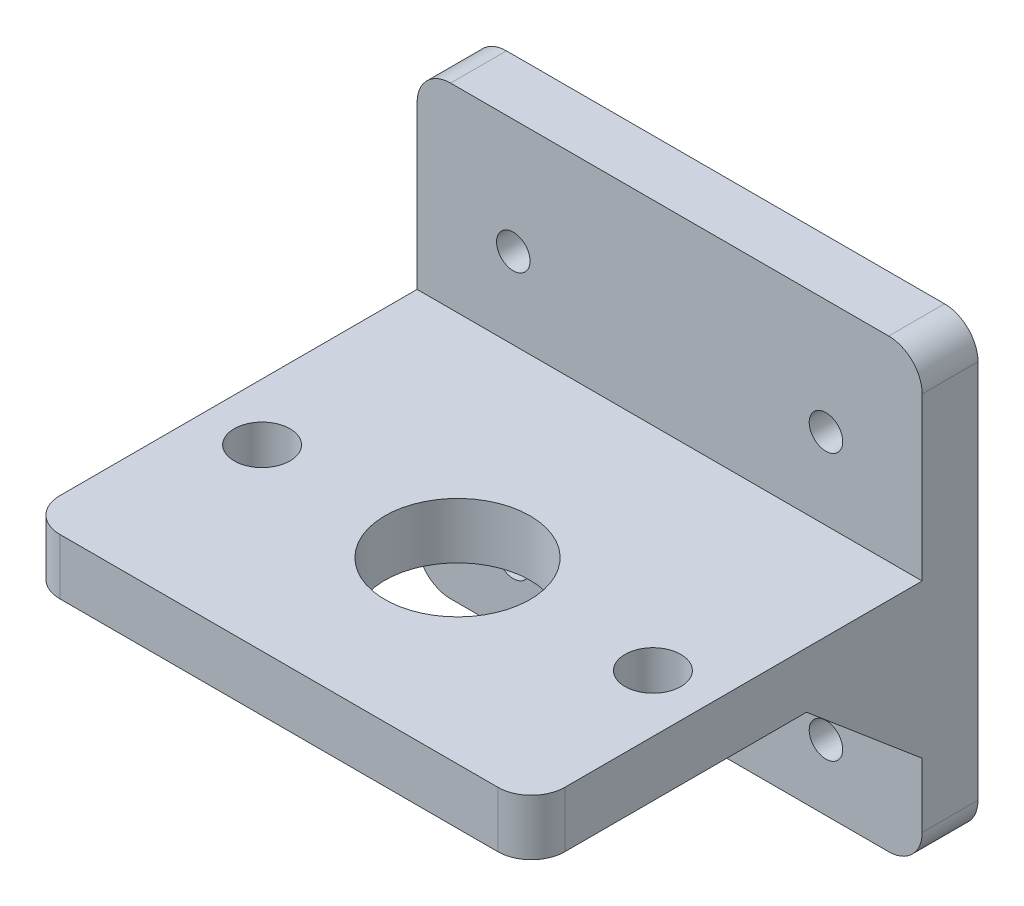
ISO-10303-21;
HEADER;
FILE_DESCRIPTION(('STEP AP214'),'2;1');
FILE_NAME('part.step','',(''),(''),'','','');
FILE_SCHEMA(('AUTOMOTIVE_DESIGN { 1 0 10303 214 1 1 1 1 }'));
ENDSEC;
DATA;
#1=APPLICATION_CONTEXT('core data for automotive mechanical design processes');
#2=APPLICATION_PROTOCOL_DEFINITION('international standard','automotive_design',2000,#1);
#3=PRODUCT_CONTEXT('',#1,'mechanical');
#4=PRODUCT('Part','Part','',(#3));
#5=PRODUCT_RELATED_PRODUCT_CATEGORY('part','',(#4));
#6=PRODUCT_DEFINITION_FORMATION('','',#4);
#7=PRODUCT_DEFINITION_CONTEXT('part definition',#1,'design');
#8=PRODUCT_DEFINITION('design','',#6,#7);
#9=PRODUCT_DEFINITION_SHAPE('','',#8);
#10=(LENGTH_UNIT() NAMED_UNIT(*) SI_UNIT(.MILLI.,.METRE.));
#11=(NAMED_UNIT(*) PLANE_ANGLE_UNIT() SI_UNIT($,.RADIAN.));
#12=(NAMED_UNIT(*) SI_UNIT($,.STERADIAN.) SOLID_ANGLE_UNIT());
#13=UNCERTAINTY_MEASURE_WITH_UNIT(LENGTH_MEASURE(1.E-05),#10,'distance_accuracy_value','');
#14=(GEOMETRIC_REPRESENTATION_CONTEXT(3) GLOBAL_UNCERTAINTY_ASSIGNED_CONTEXT((#13)) GLOBAL_UNIT_ASSIGNED_CONTEXT((#10,
#11,#12)) REPRESENTATION_CONTEXT('',''));
#15=CARTESIAN_POINT('',(0.,0.,0.));
#16=DIRECTION('',(0.,0.,1.));
#17=DIRECTION('',(1.,0.,0.));
#18=AXIS2_PLACEMENT_3D('',#15,#16,#17);
#19=CARTESIAN_POINT('',(0.,5.,0.));
#20=DIRECTION('',(0.,-1.,0.));
#21=DIRECTION('',(0.,0.,-1.));
#22=AXIS2_PLACEMENT_3D('',#19,#20,#21);
#23=PLANE('',#22);
#24=CARTESIAN_POINT('',(749.317035020137,5.,-224.098378245528));
#25=DIRECTION('',(0.,-1.,0.));
#26=DIRECTION('',(0.,0.,-1.));
#27=AXIS2_PLACEMENT_3D('',#24,#25,#26);
#28=CIRCLE('',#27,6.4999999999999);
#29=CARTESIAN_POINT('',(749.317035020137,5.,-230.598378245528));
#30=VERTEX_POINT('',#29);
#31=EDGE_CURVE('E201',#30,#30,#28,.T.);
#32=ORIENTED_EDGE('',*,*,#31,.T.);
#33=EDGE_LOOP('',(#32));
#34=FACE_BOUND('',#33,.T.);
#35=CARTESIAN_POINT('',(731.817035020137,5.,-224.098378245528));
#36=DIRECTION('',(0.,-1.,0.));
#37=DIRECTION('',(0.,0.,1.));
#38=AXIS2_PLACEMENT_3D('',#35,#36,#37);
#39=CIRCLE('',#38,2.49999999999991);
#40=CARTESIAN_POINT('',(731.817035020137,5.,-221.598378245528));
#41=VERTEX_POINT('',#40);
#42=EDGE_CURVE('E195',#41,#41,#39,.T.);
#43=ORIENTED_EDGE('',*,*,#42,.T.);
#44=EDGE_LOOP('',(#43));
#45=FACE_BOUND('',#44,.T.);
#46=CARTESIAN_POINT('',(766.817035020137,5.,-224.098378245528));
#47=DIRECTION('',(0.,-1.,0.));
#48=DIRECTION('',(0.,0.,-1.));
#49=AXIS2_PLACEMENT_3D('',#46,#47,#48);
#50=CIRCLE('',#49,2.49999999999991);
#51=CARTESIAN_POINT('',(766.817035020137,5.,-226.598378245528));
#52=VERTEX_POINT('',#51);
#53=EDGE_CURVE('E188',#52,#52,#50,.T.);
#54=ORIENTED_EDGE('',*,*,#53,.T.);
#55=EDGE_LOOP('',(#54));
#56=FACE_BOUND('',#55,.T.);
#57=DIRECTION('',(1.,0.,0.));
#58=VECTOR('',#57,1.);
#59=CARTESIAN_POINT('',(726.700216719834,5.,-208.095988113008));
#60=LINE('',#59,#58);
#61=CARTESIAN_POINT('',(729.700216719834,5.,-208.095988113008));
#62=VERTEX_POINT('',#61);
#63=CARTESIAN_POINT('',(768.933853320441,5.,-208.095988113008));
#64=VERTEX_POINT('',#63);
#65=EDGE_CURVE('E209',#62,#64,#60,.T.);
#66=ORIENTED_EDGE('',*,*,#65,.T.);
#67=CARTESIAN_POINT('',(768.933853320441,5.,-211.095988113008));
#68=DIRECTION('',(0.,-1.,0.));
#69=DIRECTION('',(0.,0.,-1.));
#70=AXIS2_PLACEMENT_3D('',#67,#68,#69);
#71=CIRCLE('',#70,3.);
#72=CARTESIAN_POINT('',(771.933853320441,5.,-211.095988113008));
#73=VERTEX_POINT('',#72);
#74=EDGE_CURVE('E240',#64,#73,#71,.F.);
#75=ORIENTED_EDGE('',*,*,#74,.T.);
#76=DIRECTION('',(0.,0.,-1.));
#77=VECTOR('',#76,1.);
#78=CARTESIAN_POINT('',(771.933853320441,5.,-208.095988113008));
#79=LINE('',#78,#77);
#80=CARTESIAN_POINT('',(771.933853320441,5.,-243.095988113008));
#81=VERTEX_POINT('',#80);
#82=EDGE_CURVE('E213',#73,#81,#79,.T.);
#83=ORIENTED_EDGE('',*,*,#82,.T.);
#84=DIRECTION('',(1.,0.,0.));
#85=VECTOR('',#84,1.);
#86=CARTESIAN_POINT('',(0.,5.,-243.095988113008));
#87=LINE('',#86,#85);
#88=CARTESIAN_POINT('',(726.700216719834,5.,-243.095988113008));
#89=VERTEX_POINT('',#88);
#90=EDGE_CURVE('E178',#89,#81,#87,.T.);
#91=ORIENTED_EDGE('',*,*,#90,.F.);
#92=DIRECTION('',(0.,0.,1.));
#93=VECTOR('',#92,1.);
#94=CARTESIAN_POINT('',(726.700216719834,5.,-208.095988113008));
#95=LINE('',#94,#93);
#96=CARTESIAN_POINT('',(726.700216719834,5.,-211.095988113008));
#97=VERTEX_POINT('',#96);
#98=EDGE_CURVE('E206',#89,#97,#95,.T.);
#99=ORIENTED_EDGE('',*,*,#98,.T.);
#100=CARTESIAN_POINT('',(729.700216719834,5.,-211.095988113008));
#101=DIRECTION('',(0.,-1.,0.));
#102=DIRECTION('',(0.,0.,-1.));
#103=AXIS2_PLACEMENT_3D('',#100,#101,#102);
#104=CIRCLE('',#103,3.);
#105=EDGE_CURVE('E238',#97,#62,#104,.F.);
#106=ORIENTED_EDGE('',*,*,#105,.T.);
#107=EDGE_LOOP('',(#66,#75,#83,#91,#99,#106));
#108=FACE_BOUND('',#107,.T.);
#109=ADVANCED_FACE('F33',(#34,#45,#56,#108),#23,.F.);
#110=CARTESIAN_POINT('',(0.,0.,0.));
#111=DIRECTION('',(0.,-1.,0.));
#112=DIRECTION('',(0.,0.,-1.));
#113=AXIS2_PLACEMENT_3D('',#110,#111,#112);
#114=PLANE('',#113);
#115=DIRECTION('',(0.,0.,-1.));
#116=VECTOR('',#115,1.);
#117=CARTESIAN_POINT('',(771.933853320441,0.,-208.095988113008));
#118=LINE('',#117,#116);
#119=CARTESIAN_POINT('',(771.933853320441,0.,-211.095988113008));
#120=VERTEX_POINT('',#119);
#121=CARTESIAN_POINT('',(771.933853320441,0.,-232.738341259662));
#122=VERTEX_POINT('',#121);
#123=EDGE_CURVE('E210',#120,#122,#118,.T.);
#124=ORIENTED_EDGE('',*,*,#123,.F.);
#125=CARTESIAN_POINT('',(768.933853320441,0.,-211.095988113008));
#126=DIRECTION('',(0.,-1.,0.));
#127=DIRECTION('',(0.,0.,-1.));
#128=AXIS2_PLACEMENT_3D('',#125,#126,#127);
#129=CIRCLE('',#128,3.);
#130=CARTESIAN_POINT('',(768.933853320441,0.,-208.095988113008));
#131=VERTEX_POINT('',#130);
#132=EDGE_CURVE('E231',#120,#131,#129,.T.);
#133=ORIENTED_EDGE('',*,*,#132,.T.);
#134=DIRECTION('',(1.,0.,0.));
#135=VECTOR('',#134,1.);
#136=CARTESIAN_POINT('',(726.700216719834,0.,-208.095988113008));
#137=LINE('',#136,#135);
#138=CARTESIAN_POINT('',(729.700216719834,0.,-208.095988113008));
#139=VERTEX_POINT('',#138);
#140=EDGE_CURVE('E218',#139,#131,#137,.T.);
#141=ORIENTED_EDGE('',*,*,#140,.F.);
#142=CARTESIAN_POINT('',(729.700216719834,0.,-211.095988113008));
#143=DIRECTION('',(0.,-1.,0.));
#144=DIRECTION('',(0.,0.,-1.));
#145=AXIS2_PLACEMENT_3D('',#142,#143,#144);
#146=CIRCLE('',#145,3.);
#147=CARTESIAN_POINT('',(726.700216719834,0.,-211.095988113008));
#148=VERTEX_POINT('',#147);
#149=EDGE_CURVE('E229',#139,#148,#146,.T.);
#150=ORIENTED_EDGE('',*,*,#149,.T.);
#151=DIRECTION('',(0.,0.,1.));
#152=VECTOR('',#151,1.);
#153=CARTESIAN_POINT('',(726.700216719834,0.,-208.095988113008));
#154=LINE('',#153,#152);
#155=CARTESIAN_POINT('',(726.700216719834,0.,-232.738341259662));
#156=VERTEX_POINT('',#155);
#157=EDGE_CURVE('E191',#156,#148,#154,.T.);
#158=ORIENTED_EDGE('',*,*,#157,.F.);
#159=DIRECTION('',(-1.,0.,0.));
#160=VECTOR('',#159,1.);
#161=CARTESIAN_POINT('',(785.492737800317,0.,-232.738341259662));
#162=LINE('',#161,#160);
#163=EDGE_CURVE('E161',#122,#156,#162,.T.);
#164=ORIENTED_EDGE('',*,*,#163,.F.);
#165=EDGE_LOOP('',(#124,#133,#141,#150,#158,#164));
#166=FACE_BOUND('',#165,.T.);
#167=CARTESIAN_POINT('',(766.817035020137,0.,-224.098378245528));
#168=DIRECTION('',(0.,-1.,0.));
#169=DIRECTION('',(0.,0.,-1.));
#170=AXIS2_PLACEMENT_3D('',#167,#168,#169);
#171=CIRCLE('',#170,2.49999999999991);
#172=CARTESIAN_POINT('',(766.817035020137,0.,-226.598378245528));
#173=VERTEX_POINT('',#172);
#174=EDGE_CURVE('E192',#173,#173,#171,.T.);
#175=ORIENTED_EDGE('',*,*,#174,.F.);
#176=EDGE_LOOP('',(#175));
#177=FACE_BOUND('',#176,.T.);
#178=CARTESIAN_POINT('',(731.817035020137,0.,-224.098378245528));
#179=DIRECTION('',(0.,-1.,0.));
#180=DIRECTION('',(0.,0.,1.));
#181=AXIS2_PLACEMENT_3D('',#178,#179,#180);
#182=CIRCLE('',#181,2.49999999999991);
#183=CARTESIAN_POINT('',(731.817035020137,0.,-221.598378245528));
#184=VERTEX_POINT('',#183);
#185=EDGE_CURVE('E198',#184,#184,#182,.T.);
#186=ORIENTED_EDGE('',*,*,#185,.F.);
#187=EDGE_LOOP('',(#186));
#188=FACE_BOUND('',#187,.T.);
#189=CARTESIAN_POINT('',(749.317035020137,0.,-224.098378245528));
#190=DIRECTION('',(0.,-1.,0.));
#191=DIRECTION('',(0.,0.,-1.));
#192=AXIS2_PLACEMENT_3D('',#189,#190,#191);
#193=CIRCLE('',#192,6.4999999999999);
#194=CARTESIAN_POINT('',(749.317035020137,0.,-230.598378245528));
#195=VERTEX_POINT('',#194);
#196=EDGE_CURVE('E187',#195,#195,#193,.T.);
#197=ORIENTED_EDGE('',*,*,#196,.F.);
#198=EDGE_LOOP('',(#197));
#199=FACE_BOUND('',#198,.T.);
#200=ADVANCED_FACE('F301',(#166,#177,#188,#199),#114,.T.);
#201=CARTESIAN_POINT('',(726.700216719834,5.,-208.095988113008));
#202=DIRECTION('',(1.,0.,0.));
#203=DIRECTION('',(0.,0.,-1.));
#204=AXIS2_PLACEMENT_3D('',#201,#202,#203);
#205=PLANE('',#204);
#206=DIRECTION('',(0.,-1.,0.));
#207=VECTOR('',#206,1.);
#208=CARTESIAN_POINT('',(726.700216719834,5.,-248.095988113008));
#209=LINE('',#208,#207);
#210=CARTESIAN_POINT('',(726.700216719834,19.5,-248.095988113008));
#211=VERTEX_POINT('',#210);
#212=CARTESIAN_POINT('',(726.700216719834,-14.5,-248.095988113008));
#213=VERTEX_POINT('',#212);
#214=EDGE_CURVE('E216',#211,#213,#209,.T.);
#215=ORIENTED_EDGE('',*,*,#214,.T.);
#216=DIRECTION('',(0.,0.,-1.));
#217=VECTOR('',#216,1.);
#218=CARTESIAN_POINT('',(726.700216719834,-14.5,-243.095988113008));
#219=LINE('',#218,#217);
#220=CARTESIAN_POINT('',(726.700216719834,-14.5,-243.095988113008));
#221=VERTEX_POINT('',#220);
#222=EDGE_CURVE('E148',#213,#221,#219,.F.);
#223=ORIENTED_EDGE('',*,*,#222,.T.);
#224=DIRECTION('',(0.,1.,0.));
#225=VECTOR('',#224,1.);
#226=CARTESIAN_POINT('',(726.700216719834,-17.5,-243.095988113008));
#227=LINE('',#226,#225);
#228=CARTESIAN_POINT('',(726.700216719834,-8.75000000000001,-243.095988113008));
#229=VERTEX_POINT('',#228);
#230=EDGE_CURVE('E140',#221,#229,#227,.T.);
#231=ORIENTED_EDGE('',*,*,#230,.T.);
#232=DIRECTION('',(0.,0.645333324654129,0.763901106224391));
#233=VECTOR('',#232,1.);
#234=CARTESIAN_POINT('',(726.700216719834,0.,-232.738341259662));
#235=LINE('',#234,#233);
#236=EDGE_CURVE('E145',#229,#156,#235,.T.);
#237=ORIENTED_EDGE('',*,*,#236,.T.);
#238=ORIENTED_EDGE('',*,*,#157,.T.);
#239=DIRECTION('',(0.,-1.,0.));
#240=VECTOR('',#239,1.);
#241=CARTESIAN_POINT('',(726.700216719834,5.,-211.095988113008));
#242=LINE('',#241,#240);
#243=EDGE_CURVE('E242',#148,#97,#242,.F.);
#244=ORIENTED_EDGE('',*,*,#243,.T.);
#245=ORIENTED_EDGE('',*,*,#98,.F.);
#246=CARTESIAN_POINT('',(726.700216719834,19.5,-243.095988113008));
#247=VERTEX_POINT('',#246);
#248=EDGE_CURVE('E153',#89,#247,#227,.T.);
#249=ORIENTED_EDGE('',*,*,#248,.T.);
#250=DIRECTION('',(0.,0.,-1.));
#251=VECTOR('',#250,1.);
#252=CARTESIAN_POINT('',(726.700216719834,19.5,-248.095988113008));
#253=LINE('',#252,#251);
#254=EDGE_CURVE('E257',#247,#211,#253,.T.);
#255=ORIENTED_EDGE('',*,*,#254,.T.);
#256=EDGE_LOOP('',(#215,#223,#231,#237,#238,#244,#245,#249,#255));
#257=FACE_BOUND('',#256,.T.);
#258=ADVANCED_FACE('F143',(#257),#205,.F.);
#259=CARTESIAN_POINT('',(726.700216719834,5.,-208.095988113008));
#260=DIRECTION('',(0.,0.,-1.));
#261=DIRECTION('',(-1.,0.,0.));
#262=AXIS2_PLACEMENT_3D('',#259,#260,#261);
#263=PLANE('',#262);
#264=ORIENTED_EDGE('',*,*,#140,.T.);
#265=DIRECTION('',(0.,-1.,0.));
#266=VECTOR('',#265,1.);
#267=CARTESIAN_POINT('',(768.933853320441,5.,-208.095988113008));
#268=LINE('',#267,#266);
#269=EDGE_CURVE('E236',#131,#64,#268,.F.);
#270=ORIENTED_EDGE('',*,*,#269,.T.);
#271=ORIENTED_EDGE('',*,*,#65,.F.);
#272=DIRECTION('',(0.,-1.,0.));
#273=VECTOR('',#272,1.);
#274=CARTESIAN_POINT('',(729.700216719834,5.,-208.095988113008));
#275=LINE('',#274,#273);
#276=EDGE_CURVE('E233',#62,#139,#275,.T.);
#277=ORIENTED_EDGE('',*,*,#276,.T.);
#278=EDGE_LOOP('',(#264,#270,#271,#277));
#279=FACE_BOUND('',#278,.T.);
#280=ADVANCED_FACE('F304',(#279),#263,.F.);
#281=CARTESIAN_POINT('',(771.933853320441,5.,-208.095988113008));
#282=DIRECTION('',(-1.,0.,0.));
#283=DIRECTION('',(0.,0.,1.));
#284=AXIS2_PLACEMENT_3D('',#281,#282,#283);
#285=PLANE('',#284);
#286=DIRECTION('',(0.,-1.,0.));
#287=VECTOR('',#286,1.);
#288=CARTESIAN_POINT('',(771.933853320441,-17.5,-243.095988113008));
#289=LINE('',#288,#287);
#290=CARTESIAN_POINT('',(771.933853320441,-8.75000000000001,-243.095988113008));
#291=VERTEX_POINT('',#290);
#292=CARTESIAN_POINT('',(771.933853320441,-14.5,-243.095988113008));
#293=VERTEX_POINT('',#292);
#294=EDGE_CURVE('E167',#291,#293,#289,.T.);
#295=ORIENTED_EDGE('',*,*,#294,.T.);
#296=DIRECTION('',(0.,0.,-1.));
#297=VECTOR('',#296,1.);
#298=CARTESIAN_POINT('',(771.933853320441,-14.5,-248.095988113008));
#299=LINE('',#298,#297);
#300=CARTESIAN_POINT('',(771.933853320441,-14.5,-248.095988113008));
#301=VERTEX_POINT('',#300);
#302=EDGE_CURVE('E267',#293,#301,#299,.T.);
#303=ORIENTED_EDGE('',*,*,#302,.T.);
#304=DIRECTION('',(0.,-1.,0.));
#305=VECTOR('',#304,1.);
#306=CARTESIAN_POINT('',(771.933853320441,5.,-248.095988113008));
#307=LINE('',#306,#305);
#308=CARTESIAN_POINT('',(771.933853320441,19.5,-248.095988113008));
#309=VERTEX_POINT('',#308);
#310=EDGE_CURVE('E223',#309,#301,#307,.T.);
#311=ORIENTED_EDGE('',*,*,#310,.F.);
#312=DIRECTION('',(0.,0.,-1.));
#313=VECTOR('',#312,1.);
#314=CARTESIAN_POINT('',(771.933853320441,19.5,-243.095988113008));
#315=LINE('',#314,#313);
#316=CARTESIAN_POINT('',(771.933853320441,19.5,-243.095988113008));
#317=VERTEX_POINT('',#316);
#318=EDGE_CURVE('E265',#309,#317,#315,.F.);
#319=ORIENTED_EDGE('',*,*,#318,.T.);
#320=EDGE_CURVE('E172',#317,#81,#289,.T.);
#321=ORIENTED_EDGE('',*,*,#320,.T.);
#322=ORIENTED_EDGE('',*,*,#82,.F.);
#323=DIRECTION('',(0.,-1.,0.));
#324=VECTOR('',#323,1.);
#325=CARTESIAN_POINT('',(771.933853320441,5.,-211.095988113008));
#326=LINE('',#325,#324);
#327=EDGE_CURVE('E226',#73,#120,#326,.T.);
#328=ORIENTED_EDGE('',*,*,#327,.T.);
#329=ORIENTED_EDGE('',*,*,#123,.T.);
#330=DIRECTION('',(0.,-0.645333324654129,-0.763901106224391));
#331=VECTOR('',#330,1.);
#332=CARTESIAN_POINT('',(771.933853320441,0.,-232.738341259662));
#333=LINE('',#332,#331);
#334=EDGE_CURVE('E169',#122,#291,#333,.T.);
#335=ORIENTED_EDGE('',*,*,#334,.T.);
#336=EDGE_LOOP('',(#295,#303,#311,#319,#321,#322,#328,#329,#335));
#337=FACE_BOUND('',#336,.T.);
#338=ADVANCED_FACE('F294',(#337),#285,.F.);
#339=CARTESIAN_POINT('',(726.700216719834,5.,-248.095988113008));
#340=DIRECTION('',(0.,0.,1.));
#341=DIRECTION('',(1.,0.,0.));
#342=AXIS2_PLACEMENT_3D('',#339,#340,#341);
#343=PLANE('',#342);
#344=CARTESIAN_POINT('',(735.317035020137,12.25,-248.095988113008));
#345=DIRECTION('',(0.,0.,1.));
#346=DIRECTION('',(1.,0.,0.));
#347=AXIS2_PLACEMENT_3D('',#344,#345,#346);
#348=CIRCLE('',#347,1.49999999999997);
#349=CARTESIAN_POINT('',(736.817035020137,12.25,-248.095988113008));
#350=VERTEX_POINT('',#349);
#351=EDGE_CURVE('E513',#350,#350,#348,.T.);
#352=ORIENTED_EDGE('',*,*,#351,.T.);
#353=EDGE_LOOP('',(#352));
#354=FACE_BOUND('',#353,.T.);
#355=CARTESIAN_POINT('',(763.317035020137,-11.625,-248.095988113008));
#356=DIRECTION('',(0.,0.,1.));
#357=DIRECTION('',(1.,0.,0.));
#358=AXIS2_PLACEMENT_3D('',#355,#356,#357);
#359=CIRCLE('',#358,1.49999999999997);
#360=CARTESIAN_POINT('',(764.817035020137,-11.625,-248.095988113008));
#361=VERTEX_POINT('',#360);
#362=EDGE_CURVE('E495',#361,#361,#359,.T.);
#363=ORIENTED_EDGE('',*,*,#362,.T.);
#364=EDGE_LOOP('',(#363));
#365=FACE_BOUND('',#364,.T.);
#366=CARTESIAN_POINT('',(735.317035020137,-11.625,-248.095988113008));
#367=DIRECTION('',(0.,0.,1.));
#368=DIRECTION('',(1.,0.,0.));
#369=AXIS2_PLACEMENT_3D('',#366,#367,#368);
#370=CIRCLE('',#369,1.49999999999997);
#371=CARTESIAN_POINT('',(736.817035020137,-11.625,-248.095988113008));
#372=VERTEX_POINT('',#371);
#373=EDGE_CURVE('E499',#372,#372,#370,.T.);
#374=ORIENTED_EDGE('',*,*,#373,.T.);
#375=EDGE_LOOP('',(#374));
#376=FACE_BOUND('',#375,.T.);
#377=CARTESIAN_POINT('',(763.317035020137,12.25,-248.095988113008));
#378=DIRECTION('',(0.,0.,1.));
#379=DIRECTION('',(1.,0.,0.));
#380=AXIS2_PLACEMENT_3D('',#377,#378,#379);
#381=CIRCLE('',#380,1.49999999999997);
#382=CARTESIAN_POINT('',(764.817035020137,12.25,-248.095988113008));
#383=VERTEX_POINT('',#382);
#384=EDGE_CURVE('E162',#383,#383,#381,.T.);
#385=ORIENTED_EDGE('',*,*,#384,.T.);
#386=EDGE_LOOP('',(#385));
#387=FACE_BOUND('',#386,.T.);
#388=DIRECTION('',(-1.,0.,0.));
#389=VECTOR('',#388,1.);
#390=CARTESIAN_POINT('',(726.700216719834,-17.5,-248.095988113008));
#391=LINE('',#390,#389);
#392=CARTESIAN_POINT('',(768.933853320441,-17.5,-248.095988113008));
#393=VERTEX_POINT('',#392);
#394=CARTESIAN_POINT('',(729.700216719834,-17.5,-248.095988113008));
#395=VERTEX_POINT('',#394);
#396=EDGE_CURVE('E179',#393,#395,#391,.T.);
#397=ORIENTED_EDGE('',*,*,#396,.T.);
#398=CARTESIAN_POINT('',(729.700216719834,-14.5,-248.095988113008));
#399=DIRECTION('',(0.,0.,1.));
#400=DIRECTION('',(1.,0.,0.));
#401=AXIS2_PLACEMENT_3D('',#398,#399,#400);
#402=CIRCLE('',#401,3.);
#403=EDGE_CURVE('E255',#395,#213,#402,.F.);
#404=ORIENTED_EDGE('',*,*,#403,.T.);
#405=ORIENTED_EDGE('',*,*,#214,.F.);
#406=CARTESIAN_POINT('',(729.700216719834,19.5,-248.095988113008));
#407=DIRECTION('',(0.,0.,1.));
#408=DIRECTION('',(1.,0.,0.));
#409=AXIS2_PLACEMENT_3D('',#406,#407,#408);
#410=CIRCLE('',#409,3.);
#411=CARTESIAN_POINT('',(729.700216719834,22.5,-248.095988113008));
#412=VERTEX_POINT('',#411);
#413=EDGE_CURVE('E251',#211,#412,#410,.F.);
#414=ORIENTED_EDGE('',*,*,#413,.T.);
#415=DIRECTION('',(1.,0.,0.));
#416=VECTOR('',#415,1.);
#417=CARTESIAN_POINT('',(726.700216719834,22.5,-248.095988113008));
#418=LINE('',#417,#416);
#419=CARTESIAN_POINT('',(768.933853320441,22.5,-248.095988113008));
#420=VERTEX_POINT('',#419);
#421=EDGE_CURVE('E182',#412,#420,#418,.T.);
#422=ORIENTED_EDGE('',*,*,#421,.T.);
#423=CARTESIAN_POINT('',(768.933853320441,19.5,-248.095988113008));
#424=DIRECTION('',(0.,0.,1.));
#425=DIRECTION('',(1.,0.,0.));
#426=AXIS2_PLACEMENT_3D('',#423,#424,#425);
#427=CIRCLE('',#426,3.);
#428=EDGE_CURVE('E249',#420,#309,#427,.F.);
#429=ORIENTED_EDGE('',*,*,#428,.T.);
#430=ORIENTED_EDGE('',*,*,#310,.T.);
#431=CARTESIAN_POINT('',(768.933853320441,-14.5,-248.095988113008));
#432=DIRECTION('',(0.,0.,1.));
#433=DIRECTION('',(1.,0.,0.));
#434=AXIS2_PLACEMENT_3D('',#431,#432,#433);
#435=CIRCLE('',#434,3.);
#436=EDGE_CURVE('E253',#301,#393,#435,.F.);
#437=ORIENTED_EDGE('',*,*,#436,.T.);
#438=EDGE_LOOP('',(#397,#404,#405,#414,#422,#429,#430,#437));
#439=FACE_BOUND('',#438,.T.);
#440=ADVANCED_FACE('F277',(#354,#365,#376,#387,#439),#343,.F.);
#441=CARTESIAN_POINT('',(749.317035020137,5.,-224.098378245528));
#442=DIRECTION('',(0.,-1.,0.));
#443=DIRECTION('',(0.,0.,-1.));
#444=AXIS2_PLACEMENT_3D('',#441,#442,#443);
#445=CYLINDRICAL_SURFACE('',#444,6.4999999999999);
#446=ORIENTED_EDGE('',*,*,#31,.F.);
#447=EDGE_LOOP('',(#446));
#448=FACE_BOUND('',#447,.T.);
#449=ORIENTED_EDGE('',*,*,#196,.T.);
#450=EDGE_LOOP('',(#449));
#451=FACE_BOUND('',#450,.T.);
#452=ADVANCED_FACE('F330',(#448,#451),#445,.F.);
#453=CARTESIAN_POINT('',(731.817035020137,5.,-224.098378245528));
#454=DIRECTION('',(0.,-1.,0.));
#455=DIRECTION('',(0.,0.,-1.));
#456=AXIS2_PLACEMENT_3D('',#453,#454,#455);
#457=CYLINDRICAL_SURFACE('',#456,2.49999999999991);
#458=ORIENTED_EDGE('',*,*,#42,.F.);
#459=EDGE_LOOP('',(#458));
#460=FACE_BOUND('',#459,.T.);
#461=ORIENTED_EDGE('',*,*,#185,.T.);
#462=EDGE_LOOP('',(#461));
#463=FACE_BOUND('',#462,.T.);
#464=ADVANCED_FACE('F367',(#460,#463),#457,.F.);
#465=CARTESIAN_POINT('',(766.817035020137,5.,-224.098378245528));
#466=DIRECTION('',(0.,-1.,0.));
#467=DIRECTION('',(0.,0.,-1.));
#468=AXIS2_PLACEMENT_3D('',#465,#466,#467);
#469=CYLINDRICAL_SURFACE('',#468,2.49999999999991);
#470=ORIENTED_EDGE('',*,*,#53,.F.);
#471=EDGE_LOOP('',(#470));
#472=FACE_BOUND('',#471,.T.);
#473=ORIENTED_EDGE('',*,*,#174,.T.);
#474=EDGE_LOOP('',(#473));
#475=FACE_BOUND('',#474,.T.);
#476=ADVANCED_FACE('F374',(#472,#475),#469,.F.);
#477=CARTESIAN_POINT('',(726.700216719834,-17.5,-243.095988113008));
#478=DIRECTION('',(0.,-1.,0.));
#479=DIRECTION('',(0.,0.,-1.));
#480=AXIS2_PLACEMENT_3D('',#477,#478,#479);
#481=PLANE('',#480);
#482=DIRECTION('',(-1.,0.,0.));
#483=VECTOR('',#482,1.);
#484=CARTESIAN_POINT('',(726.700216719834,-17.5,-243.095988113008));
#485=LINE('',#484,#483);
#486=CARTESIAN_POINT('',(768.933853320441,-17.5,-243.095988113008));
#487=VERTEX_POINT('',#486);
#488=CARTESIAN_POINT('',(729.700216719834,-17.5,-243.095988113008));
#489=VERTEX_POINT('',#488);
#490=EDGE_CURVE('E174',#487,#489,#485,.T.);
#491=ORIENTED_EDGE('',*,*,#490,.T.);
#492=DIRECTION('',(0.,0.,-1.));
#493=VECTOR('',#492,1.);
#494=CARTESIAN_POINT('',(729.700216719834,-17.5,-248.095988113008));
#495=LINE('',#494,#493);
#496=EDGE_CURVE('E246',#489,#395,#495,.T.);
#497=ORIENTED_EDGE('',*,*,#496,.T.);
#498=ORIENTED_EDGE('',*,*,#396,.F.);
#499=DIRECTION('',(0.,0.,-1.));
#500=VECTOR('',#499,1.);
#501=CARTESIAN_POINT('',(768.933853320441,-17.5,-243.095988113008));
#502=LINE('',#501,#500);
#503=EDGE_CURVE('E244',#393,#487,#502,.F.);
#504=ORIENTED_EDGE('',*,*,#503,.T.);
#505=EDGE_LOOP('',(#491,#497,#498,#504));
#506=FACE_BOUND('',#505,.T.);
#507=ADVANCED_FACE('F381',(#506),#481,.T.);
#508=CARTESIAN_POINT('',(0.,0.,-243.095988113008));
#509=DIRECTION('',(0.,0.,-1.));
#510=DIRECTION('',(-1.,0.,0.));
#511=AXIS2_PLACEMENT_3D('',#508,#509,#510);
#512=PLANE('',#511);
#513=CARTESIAN_POINT('',(763.317035020137,-11.625,-243.095988113008));
#514=DIRECTION('',(0.,0.,1.));
#515=DIRECTION('',(1.,0.,0.));
#516=AXIS2_PLACEMENT_3D('',#513,#514,#515);
#517=CIRCLE('',#516,1.49999999999997);
#518=CARTESIAN_POINT('',(764.817035020137,-11.625,-243.095988113008));
#519=VERTEX_POINT('',#518);
#520=EDGE_CURVE('E498',#519,#519,#517,.T.);
#521=ORIENTED_EDGE('',*,*,#520,.F.);
#522=EDGE_LOOP('',(#521));
#523=FACE_BOUND('',#522,.T.);
#524=CARTESIAN_POINT('',(735.317035020137,-11.625,-243.095988113008));
#525=DIRECTION('',(0.,0.,1.));
#526=DIRECTION('',(1.,0.,0.));
#527=AXIS2_PLACEMENT_3D('',#524,#525,#526);
#528=CIRCLE('',#527,1.49999999999997);
#529=CARTESIAN_POINT('',(736.817035020137,-11.625,-243.095988113008));
#530=VERTEX_POINT('',#529);
#531=EDGE_CURVE('E504',#530,#530,#528,.T.);
#532=ORIENTED_EDGE('',*,*,#531,.F.);
#533=EDGE_LOOP('',(#532));
#534=FACE_BOUND('',#533,.T.);
#535=ORIENTED_EDGE('',*,*,#230,.F.);
#536=CARTESIAN_POINT('',(729.700216719834,-14.5,-243.095988113008));
#537=DIRECTION('',(0.,0.,-1.));
#538=DIRECTION('',(-1.,0.,0.));
#539=AXIS2_PLACEMENT_3D('',#536,#537,#538);
#540=CIRCLE('',#539,3.);
#541=EDGE_CURVE('E263',#221,#489,#540,.F.);
#542=ORIENTED_EDGE('',*,*,#541,.T.);
#543=ORIENTED_EDGE('',*,*,#490,.F.);
#544=CARTESIAN_POINT('',(768.933853320441,-14.5,-243.095988113008));
#545=DIRECTION('',(0.,0.,-1.));
#546=DIRECTION('',(-1.,0.,0.));
#547=AXIS2_PLACEMENT_3D('',#544,#545,#546);
#548=CIRCLE('',#547,3.);
#549=EDGE_CURVE('E261',#487,#293,#548,.F.);
#550=ORIENTED_EDGE('',*,*,#549,.T.);
#551=ORIENTED_EDGE('',*,*,#294,.F.);
#552=DIRECTION('',(-1.,0.,0.));
#553=VECTOR('',#552,1.);
#554=CARTESIAN_POINT('',(785.492737800317,-8.75000000000001,-243.095988113008));
#555=LINE('',#554,#553);
#556=EDGE_CURVE('E158',#291,#229,#555,.T.);
#557=ORIENTED_EDGE('',*,*,#556,.T.);
#558=EDGE_LOOP('',(#535,#542,#543,#550,#551,#557));
#559=FACE_BOUND('',#558,.T.);
#560=ADVANCED_FACE('F165',(#523,#534,#559),#512,.F.);
#561=CARTESIAN_POINT('',(735.317035020137,12.25,-243.095988113008));
#562=DIRECTION('',(0.,0.,1.));
#563=DIRECTION('',(1.,0.,0.));
#564=AXIS2_PLACEMENT_3D('',#561,#562,#563);
#565=CIRCLE('',#564,1.49999999999997);
#566=CARTESIAN_POINT('',(736.817035020137,12.25,-243.095988113008));
#567=VERTEX_POINT('',#566);
#568=EDGE_CURVE('E501',#567,#567,#565,.T.);
#569=ORIENTED_EDGE('',*,*,#568,.F.);
#570=EDGE_LOOP('',(#569));
#571=FACE_BOUND('',#570,.T.);
#572=CARTESIAN_POINT('',(763.317035020137,12.25,-243.095988113008));
#573=DIRECTION('',(0.,0.,1.));
#574=DIRECTION('',(1.,0.,0.));
#575=AXIS2_PLACEMENT_3D('',#572,#573,#574);
#576=CIRCLE('',#575,1.49999999999997);
#577=CARTESIAN_POINT('',(764.817035020137,12.25,-243.095988113008));
#578=VERTEX_POINT('',#577);
#579=EDGE_CURVE('E510',#578,#578,#576,.T.);
#580=ORIENTED_EDGE('',*,*,#579,.F.);
#581=EDGE_LOOP('',(#580));
#582=FACE_BOUND('',#581,.T.);
#583=DIRECTION('',(1.,0.,0.));
#584=VECTOR('',#583,1.);
#585=CARTESIAN_POINT('',(726.700216719834,22.5,-243.095988113008));
#586=LINE('',#585,#584);
#587=CARTESIAN_POINT('',(729.700216719834,22.5,-243.095988113008));
#588=VERTEX_POINT('',#587);
#589=CARTESIAN_POINT('',(768.933853320441,22.5,-243.095988113008));
#590=VERTEX_POINT('',#589);
#591=EDGE_CURVE('E152',#588,#590,#586,.T.);
#592=ORIENTED_EDGE('',*,*,#591,.F.);
#593=CARTESIAN_POINT('',(729.700216719834,19.5,-243.095988113008));
#594=DIRECTION('',(0.,0.,-1.));
#595=DIRECTION('',(-1.,0.,0.));
#596=AXIS2_PLACEMENT_3D('',#593,#594,#595);
#597=CIRCLE('',#596,3.);
#598=EDGE_CURVE('E11',#588,#247,#597,.F.);
#599=ORIENTED_EDGE('',*,*,#598,.T.);
#600=ORIENTED_EDGE('',*,*,#248,.F.);
#601=ORIENTED_EDGE('',*,*,#90,.T.);
#602=ORIENTED_EDGE('',*,*,#320,.F.);
#603=CARTESIAN_POINT('',(768.933853320441,19.5,-243.095988113008));
#604=DIRECTION('',(0.,0.,-1.));
#605=DIRECTION('',(-1.,0.,0.));
#606=AXIS2_PLACEMENT_3D('',#603,#604,#605);
#607=CIRCLE('',#606,3.);
#608=EDGE_CURVE('E41',#317,#590,#607,.F.);
#609=ORIENTED_EDGE('',*,*,#608,.T.);
#610=EDGE_LOOP('',(#592,#599,#600,#601,#602,#609));
#611=FACE_BOUND('',#610,.T.);
#612=ADVANCED_FACE('F287',(#571,#582,#611),#512,.F.);
#613=CARTESIAN_POINT('',(726.700216719834,22.5,-243.095988113008));
#614=DIRECTION('',(0.,1.,0.));
#615=DIRECTION('',(-1.,0.,0.));
#616=AXIS2_PLACEMENT_3D('',#613,#614,#615);
#617=PLANE('',#616);
#618=ORIENTED_EDGE('',*,*,#421,.F.);
#619=DIRECTION('',(0.,0.,-1.));
#620=VECTOR('',#619,1.);
#621=CARTESIAN_POINT('',(729.700216719834,22.5,-243.095988113008));
#622=LINE('',#621,#620);
#623=EDGE_CURVE('E54',#412,#588,#622,.F.);
#624=ORIENTED_EDGE('',*,*,#623,.T.);
#625=ORIENTED_EDGE('',*,*,#591,.T.);
#626=DIRECTION('',(0.,0.,-1.));
#627=VECTOR('',#626,1.);
#628=CARTESIAN_POINT('',(768.933853320441,22.5,-248.095988113008));
#629=LINE('',#628,#627);
#630=EDGE_CURVE('E270',#590,#420,#629,.T.);
#631=ORIENTED_EDGE('',*,*,#630,.T.);
#632=EDGE_LOOP('',(#618,#624,#625,#631));
#633=FACE_BOUND('',#632,.T.);
#634=ADVANCED_FACE('F274',(#633),#617,.T.);
#635=CARTESIAN_POINT('',(785.492737800317,0.,-232.738341259662));
#636=DIRECTION('',(0.,-0.763901106224391,0.645333324654129));
#637=DIRECTION('',(0.,-0.645333324654129,-0.763901106224391));
#638=AXIS2_PLACEMENT_3D('',#635,#636,#637);
#639=PLANE('',#638);
#640=ORIENTED_EDGE('',*,*,#334,.F.);
#641=ORIENTED_EDGE('',*,*,#163,.T.);
#642=ORIENTED_EDGE('',*,*,#236,.F.);
#643=ORIENTED_EDGE('',*,*,#556,.F.);
#644=EDGE_LOOP('',(#640,#641,#642,#643));
#645=FACE_BOUND('',#644,.T.);
#646=ADVANCED_FACE('F157',(#645),#639,.T.);
#647=CARTESIAN_POINT('',(768.933853320441,5.,-211.095988113008));
#648=DIRECTION('',(0.,-1.,0.));
#649=DIRECTION('',(0.,0.,-1.));
#650=AXIS2_PLACEMENT_3D('',#647,#648,#649);
#651=CYLINDRICAL_SURFACE('',#650,3.);
#652=ORIENTED_EDGE('',*,*,#74,.F.);
#653=ORIENTED_EDGE('',*,*,#269,.F.);
#654=ORIENTED_EDGE('',*,*,#132,.F.);
#655=ORIENTED_EDGE('',*,*,#327,.F.);
#656=EDGE_LOOP('',(#652,#653,#654,#655));
#657=FACE_BOUND('',#656,.T.);
#658=ADVANCED_FACE('F297',(#657),#651,.T.);
#659=CARTESIAN_POINT('',(729.700216719834,5.,-211.095988113008));
#660=DIRECTION('',(0.,-1.,0.));
#661=DIRECTION('',(0.,0.,-1.));
#662=AXIS2_PLACEMENT_3D('',#659,#660,#661);
#663=CYLINDRICAL_SURFACE('',#662,3.);
#664=ORIENTED_EDGE('',*,*,#105,.F.);
#665=ORIENTED_EDGE('',*,*,#243,.F.);
#666=ORIENTED_EDGE('',*,*,#149,.F.);
#667=ORIENTED_EDGE('',*,*,#276,.F.);
#668=EDGE_LOOP('',(#664,#665,#666,#667));
#669=FACE_BOUND('',#668,.T.);
#670=ADVANCED_FACE('F308',(#669),#663,.T.);
#671=CARTESIAN_POINT('',(729.700216719834,-14.5,-243.095988113008));
#672=DIRECTION('',(0.,0.,1.));
#673=DIRECTION('',(1.,0.,0.));
#674=AXIS2_PLACEMENT_3D('',#671,#672,#673);
#675=CYLINDRICAL_SURFACE('',#674,3.);
#676=ORIENTED_EDGE('',*,*,#541,.F.);
#677=ORIENTED_EDGE('',*,*,#222,.F.);
#678=ORIENTED_EDGE('',*,*,#403,.F.);
#679=ORIENTED_EDGE('',*,*,#496,.F.);
#680=EDGE_LOOP('',(#676,#677,#678,#679));
#681=FACE_BOUND('',#680,.T.);
#682=ADVANCED_FACE('F311',(#681),#675,.T.);
#683=CARTESIAN_POINT('',(768.933853320441,-14.5,-208.095988113008));
#684=DIRECTION('',(0.,0.,1.));
#685=DIRECTION('',(1.,0.,0.));
#686=AXIS2_PLACEMENT_3D('',#683,#684,#685);
#687=CYLINDRICAL_SURFACE('',#686,3.);
#688=ORIENTED_EDGE('',*,*,#549,.F.);
#689=ORIENTED_EDGE('',*,*,#503,.F.);
#690=ORIENTED_EDGE('',*,*,#436,.F.);
#691=ORIENTED_EDGE('',*,*,#302,.F.);
#692=EDGE_LOOP('',(#688,#689,#690,#691));
#693=FACE_BOUND('',#692,.T.);
#694=ADVANCED_FACE('F317',(#693),#687,.T.);
#695=CARTESIAN_POINT('',(729.700216719834,19.5,-208.095988113008));
#696=DIRECTION('',(0.,0.,1.));
#697=DIRECTION('',(1.,0.,0.));
#698=AXIS2_PLACEMENT_3D('',#695,#696,#697);
#699=CYLINDRICAL_SURFACE('',#698,3.);
#700=ORIENTED_EDGE('',*,*,#598,.F.);
#701=ORIENTED_EDGE('',*,*,#623,.F.);
#702=ORIENTED_EDGE('',*,*,#413,.F.);
#703=ORIENTED_EDGE('',*,*,#254,.F.);
#704=EDGE_LOOP('',(#700,#701,#702,#703));
#705=FACE_BOUND('',#704,.T.);
#706=ADVANCED_FACE('F283',(#705),#699,.T.);
#707=CARTESIAN_POINT('',(768.933853320441,19.5,-243.095988113008));
#708=DIRECTION('',(0.,0.,1.));
#709=DIRECTION('',(1.,0.,0.));
#710=AXIS2_PLACEMENT_3D('',#707,#708,#709);
#711=CYLINDRICAL_SURFACE('',#710,3.);
#712=ORIENTED_EDGE('',*,*,#608,.F.);
#713=ORIENTED_EDGE('',*,*,#318,.F.);
#714=ORIENTED_EDGE('',*,*,#428,.F.);
#715=ORIENTED_EDGE('',*,*,#630,.F.);
#716=EDGE_LOOP('',(#712,#713,#714,#715));
#717=FACE_BOUND('',#716,.T.);
#718=ADVANCED_FACE('F35',(#717),#711,.T.);
#719=CARTESIAN_POINT('',(763.317035020137,12.25,-248.095988113008));
#720=DIRECTION('',(0.,0.,1.));
#721=DIRECTION('',(1.,0.,0.));
#722=AXIS2_PLACEMENT_3D('',#719,#720,#721);
#723=CYLINDRICAL_SURFACE('',#722,1.49999999999997);
#724=ORIENTED_EDGE('',*,*,#384,.F.);
#725=EDGE_LOOP('',(#724));
#726=FACE_BOUND('',#725,.T.);
#727=ORIENTED_EDGE('',*,*,#579,.T.);
#728=EDGE_LOOP('',(#727));
#729=FACE_BOUND('',#728,.T.);
#730=ADVANCED_FACE('F449',(#726,#729),#723,.F.);
#731=CARTESIAN_POINT('',(735.317035020137,12.25,-248.095988113008));
#732=DIRECTION('',(0.,0.,1.));
#733=DIRECTION('',(1.,0.,0.));
#734=AXIS2_PLACEMENT_3D('',#731,#732,#733);
#735=CYLINDRICAL_SURFACE('',#734,1.49999999999997);
#736=ORIENTED_EDGE('',*,*,#351,.F.);
#737=EDGE_LOOP('',(#736));
#738=FACE_BOUND('',#737,.T.);
#739=ORIENTED_EDGE('',*,*,#568,.T.);
#740=EDGE_LOOP('',(#739));
#741=FACE_BOUND('',#740,.T.);
#742=ADVANCED_FACE('F455',(#738,#741),#735,.F.);
#743=CARTESIAN_POINT('',(735.317035020137,-11.625,-248.095988113008));
#744=DIRECTION('',(0.,0.,1.));
#745=DIRECTION('',(1.,0.,0.));
#746=AXIS2_PLACEMENT_3D('',#743,#744,#745);
#747=CYLINDRICAL_SURFACE('',#746,1.49999999999997);
#748=ORIENTED_EDGE('',*,*,#373,.F.);
#749=EDGE_LOOP('',(#748));
#750=FACE_BOUND('',#749,.T.);
#751=ORIENTED_EDGE('',*,*,#531,.T.);
#752=EDGE_LOOP('',(#751));
#753=FACE_BOUND('',#752,.T.);
#754=ADVANCED_FACE('F464',(#750,#753),#747,.F.);
#755=CARTESIAN_POINT('',(763.317035020137,-11.625,-248.095988113008));
#756=DIRECTION('',(0.,0.,1.));
#757=DIRECTION('',(1.,0.,0.));
#758=AXIS2_PLACEMENT_3D('',#755,#756,#757);
#759=CYLINDRICAL_SURFACE('',#758,1.49999999999997);
#760=ORIENTED_EDGE('',*,*,#362,.F.);
#761=EDGE_LOOP('',(#760));
#762=FACE_BOUND('',#761,.T.);
#763=ORIENTED_EDGE('',*,*,#520,.T.);
#764=EDGE_LOOP('',(#763));
#765=FACE_BOUND('',#764,.T.);
#766=ADVANCED_FACE('F473',(#762,#765),#759,.F.);
#767=CLOSED_SHELL('',(#109,#200,#258,#280,#338,#440,#452,#464,#476,#507,#560,#612,#634,#646,
#658,#670,#682,#694,#706,#718,#730,#742,#754,#766));
#768=MANIFOLD_SOLID_BREP('B2',#767);
#769=ADVANCED_BREP_SHAPE_REPRESENTATION('',(#18,#768),#14);
#770=SHAPE_DEFINITION_REPRESENTATION(#9,#769);
ENDSEC;
END-ISO-10303-21;
